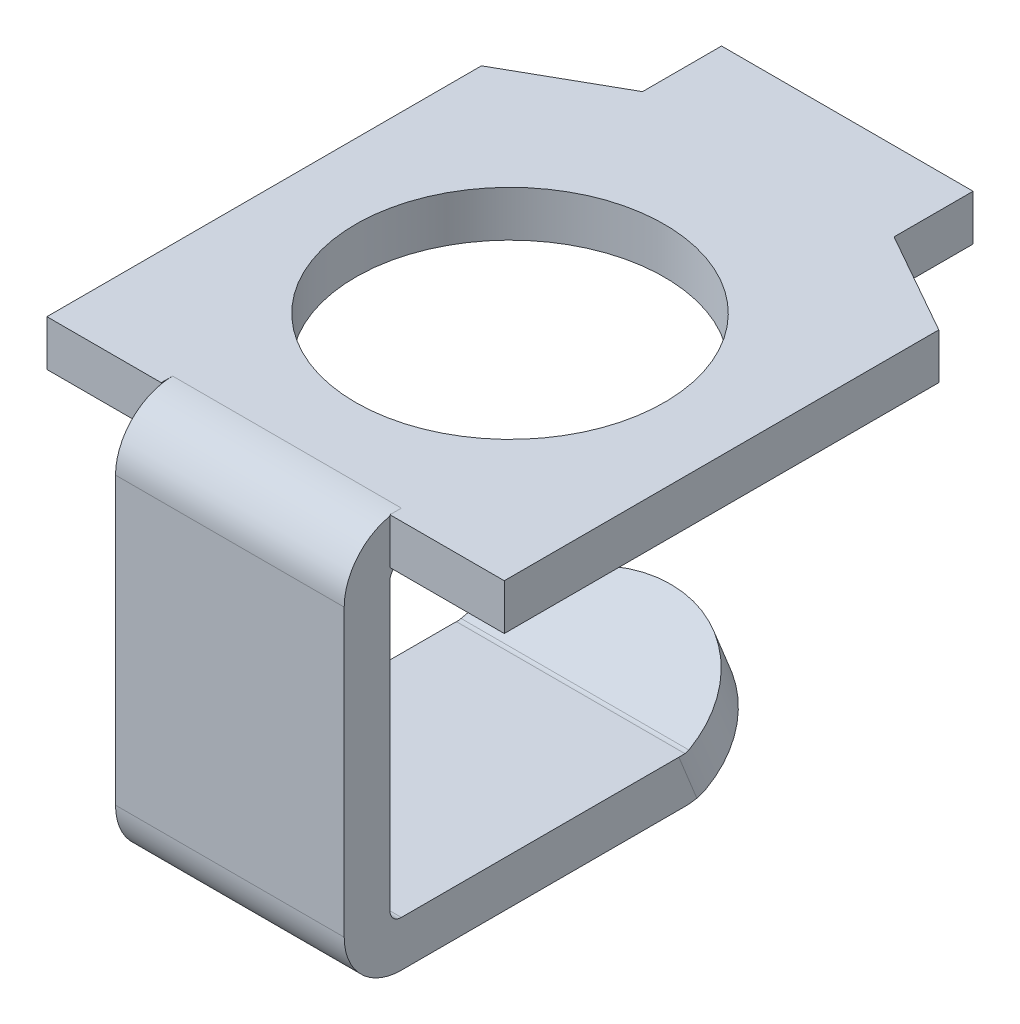
ISO-10303-21;
HEADER;
FILE_DESCRIPTION(('STEP AP214'),'2;1');
FILE_NAME('part.step','',(''),(''),'','','');
FILE_SCHEMA(('AUTOMOTIVE_DESIGN { 1 0 10303 214 1 1 1 1 }'));
ENDSEC;
DATA;
#1=APPLICATION_CONTEXT('core data for automotive mechanical design processes');
#2=APPLICATION_PROTOCOL_DEFINITION('international standard','automotive_design',2000,#1);
#3=PRODUCT_CONTEXT('',#1,'mechanical');
#4=PRODUCT('Part','Part','',(#3));
#5=PRODUCT_RELATED_PRODUCT_CATEGORY('part','',(#4));
#6=PRODUCT_DEFINITION_FORMATION('','',#4);
#7=PRODUCT_DEFINITION_CONTEXT('part definition',#1,'design');
#8=PRODUCT_DEFINITION('design','',#6,#7);
#9=PRODUCT_DEFINITION_SHAPE('','',#8);
#10=(LENGTH_UNIT() NAMED_UNIT(*) SI_UNIT(.MILLI.,.METRE.));
#11=(NAMED_UNIT(*) PLANE_ANGLE_UNIT() SI_UNIT($,.RADIAN.));
#12=(NAMED_UNIT(*) SI_UNIT($,.STERADIAN.) SOLID_ANGLE_UNIT());
#13=UNCERTAINTY_MEASURE_WITH_UNIT(LENGTH_MEASURE(1.E-05),#10,'distance_accuracy_value','');
#14=(GEOMETRIC_REPRESENTATION_CONTEXT(3) GLOBAL_UNCERTAINTY_ASSIGNED_CONTEXT((#13)) GLOBAL_UNIT_ASSIGNED_CONTEXT((#10,
#11,#12)) REPRESENTATION_CONTEXT('',''));
#15=CARTESIAN_POINT('',(0.,0.,0.));
#16=DIRECTION('',(0.,0.,1.));
#17=DIRECTION('',(1.,0.,0.));
#18=AXIS2_PLACEMENT_3D('',#15,#16,#17);
#19=CARTESIAN_POINT('',(-0.0110000000000005,-3.12632059043869,-1.00531058481528));
#20=DIRECTION('',(0.,0.374606593415892,-0.927183854566795));
#21=DIRECTION('',(0.,0.927183854566795,0.374606593415892));
#22=AXIS2_PLACEMENT_3D('',#19,#20,#21);
#23=PLANE('',#22);
#24=DIRECTION('',(1.,0.,0.));
#25=VECTOR('',#24,1.);
#26=CARTESIAN_POINT('',(0.,-3.12539340658412,-1.00493597822187));
#27=LINE('',#26,#25);
#28=CARTESIAN_POINT('',(-0.0100000000000002,-3.12539340658412,-1.00493597822187));
#29=VERTEX_POINT('',#28);
#30=CARTESIAN_POINT('',(0.00999999999999981,-3.12539340658412,-1.00493597822187));
#31=VERTEX_POINT('',#30);
#32=EDGE_CURVE('E298',#29,#31,#27,.T.);
#33=ORIENTED_EDGE('',*,*,#32,.F.);
#34=DIRECTION('',(0.,-0.927183854566789,-0.374606593415907));
#35=VECTOR('',#34,1.);
#36=CARTESIAN_POINT('',(-0.0100000000000002,-2.9272664395512,-0.924887487495394));
#37=LINE('',#36,#35);
#38=CARTESIAN_POINT('',(-0.0100000000000002,-2.75451986475741,-0.855093340855509));
#39=VERTEX_POINT('',#38);
#40=EDGE_CURVE('E196',#39,#29,#37,.T.);
#41=ORIENTED_EDGE('',*,*,#40,.F.);
#42=DIRECTION('',(-1.,0.,0.));
#43=VECTOR('',#42,1.);
#44=CARTESIAN_POINT('',(0.,-2.75451986475741,-0.85509334085551));
#45=LINE('',#44,#43);
#46=CARTESIAN_POINT('',(0.00999999999999981,-2.75451986475741,-0.85509334085551));
#47=VERTEX_POINT('',#46);
#48=EDGE_CURVE('E195',#47,#39,#45,.T.);
#49=ORIENTED_EDGE('',*,*,#48,.F.);
#50=DIRECTION('',(0.,0.92718385456679,0.374606593415905));
#51=VECTOR('',#50,1.);
#52=CARTESIAN_POINT('',(0.00999999999999981,-2.9272664395512,-0.924887487495394));
#53=LINE('',#52,#51);
#54=EDGE_CURVE('E186',#31,#47,#53,.T.);
#55=ORIENTED_EDGE('',*,*,#54,.F.);
#56=EDGE_LOOP('',(#33,#41,#49,#55));
#57=FACE_BOUND('',#56,.T.);
#58=ADVANCED_FACE('F16',(#57),#23,.T.);
#59=CARTESIAN_POINT('',(0.00999999999999981,-3.49625393406586,-0.0870239622007444));
#60=DIRECTION('',(0.,0.927183854566793,0.374606593415898));
#61=DIRECTION('',(0.,-0.374606593415898,0.927183854566793));
#62=AXIS2_PLACEMENT_3D('',#59,#60,#61);
#63=CYLINDRICAL_SURFACE('',#62,0.99);
#64=DIRECTION('',(0.,-0.92718385456679,-0.374606593415904));
#65=VECTOR('',#64,1.);
#66=CARTESIAN_POINT('',(1.,-3.29812696703294,-0.00697547147426942));
#67=LINE('',#66,#65);
#68=CARTESIAN_POINT('',(1.,-3.10000000000002,0.073073019252204));
#69=VERTEX_POINT('',#68);
#70=CARTESIAN_POINT('',(0.999999999999997,-3.48915095371944,-0.0841541718592019));
#71=VERTEX_POINT('',#70);
#72=EDGE_CURVE('E217',#69,#71,#67,.T.);
#73=ORIENTED_EDGE('',*,*,#72,.T.);
#74=CARTESIAN_POINT('',(1.,-3.48915095371944,-0.0841541718592034));
#75=CARTESIAN_POINT('',(1.00000461894513,-3.48610632466005,-0.0985067299631322));
#76=CARTESIAN_POINT('',(0.999686350895516,-3.48245409126056,-0.112658933510028));
#77=CARTESIAN_POINT('',(0.998404040806894,-3.47393441578178,-0.140562631488319));
#78=CARTESIAN_POINT('',(0.997439998767947,-3.46906697370262,-0.154314125919755));
#79=CARTESIAN_POINT('',(0.996153069734331,-3.46359192728349,-0.167865265794199));
#80=B_SPLINE_CURVE_WITH_KNOTS('',3,(#74,#75,#76,#77,#78,#79),.UNSPECIFIED.,.F.,.F.,(4,2,4),(0.,
0.0438580063078256,0.0877160126111364),.UNSPECIFIED.);
#81=CARTESIAN_POINT('',(0.996153069734284,-3.46359192728344,-0.167865265794189));
#82=VERTEX_POINT('',#81);
#83=EDGE_CURVE('E219',#71,#82,#80,.T.);
#84=ORIENTED_EDGE('',*,*,#83,.T.);
#85=CARTESIAN_POINT('',(0.00999999999999981,-3.49625393406586,-0.0870239622007446));
#86=DIRECTION('',(0.,0.927183854566793,0.374606593415898));
#87=DIRECTION('',(0.,-0.374606593415898,0.927183854566793));
#88=AXIS2_PLACEMENT_3D('',#85,#86,#87);
#89=CIRCLE('',#88,0.99);
#90=EDGE_CURVE('E209',#31,#82,#89,.F.);
#91=ORIENTED_EDGE('',*,*,#90,.F.);
#92=ORIENTED_EDGE('',*,*,#54,.T.);
#93=CARTESIAN_POINT('',(0.00999999999999981,-3.12538039223914,0.0628186751656138));
#94=DIRECTION('',(0.,0.927183854566793,0.374606593415898));
#95=DIRECTION('',(0.,-0.374606593415898,0.927183854566793));
#96=AXIS2_PLACEMENT_3D('',#93,#94,#95);
#97=CIRCLE('',#96,0.99);
#98=CARTESIAN_POINT('',(0.996153069734236,-3.0927183854567,-0.0180226284278196));
#99=VERTEX_POINT('',#98);
#100=EDGE_CURVE('E188',#99,#47,#97,.T.);
#101=ORIENTED_EDGE('',*,*,#100,.F.);
#102=CARTESIAN_POINT('',(0.996153069734236,-3.09271838545669,-0.0180226284278271));
#103=CARTESIAN_POINT('',(0.996720451579096,-3.09513259076818,-0.0120218853753864));
#104=CARTESIAN_POINT('',(0.99722057083701,-3.09694649463586,-0.00589979224094122));
#105=CARTESIAN_POINT('',(0.998086284179902,-3.09937369948629,0.00658709420572628));
#106=CARTESIAN_POINT('',(0.998451878264583,-3.09998700046638,0.0129518875184838));
#107=CARTESIAN_POINT('',(0.998750209762022,-3.10000000000002,0.019438030913781));
#108=B_SPLINE_CURVE_WITH_KNOTS('',3,(#102,#103,#104,#105,#106,#107),.UNSPECIFIED.,.F.,.F.,(4,2,
4),(0.,0.019214148894534,0.0384282978314385),.UNSPECIFIED.);
#109=CARTESIAN_POINT('',(0.998750209762022,-3.10000000000002,0.0194380309137797));
#110=VERTEX_POINT('',#109);
#111=EDGE_CURVE('E20',#99,#110,#108,.T.);
#112=ORIENTED_EDGE('',*,*,#111,.T.);
#113=CARTESIAN_POINT('',(0.00999999999999981,-3.10000000000002,0.0730730192522024));
#114=DIRECTION('',(0.,1.,0.));
#115=DIRECTION('',(0.,0.,1.));
#116=AXIS2_PLACEMENT_3D('',#113,#114,#115);
#117=ELLIPSE('',#116,1.0677493952508,0.99);
#118=EDGE_CURVE('E185',#110,#69,#117,.F.);
#119=ORIENTED_EDGE('',*,*,#118,.T.);
#120=EDGE_LOOP('',(#73,#84,#91,#92,#101,#112,#119));
#121=FACE_BOUND('',#120,.T.);
#122=ADVANCED_FACE('F190',(#121),#63,.T.);
#123=CARTESIAN_POINT('',(-0.0100000000000002,-3.10000000000002,0.073073019252206));
#124=DIRECTION('',(0.,-0.927183854566793,-0.3746065934159));
#125=DIRECTION('',(0.,0.3746065934159,-0.927183854566793));
#126=AXIS2_PLACEMENT_3D('',#123,#124,#125);
#127=CYLINDRICAL_SURFACE('',#126,0.99);
#128=ORIENTED_EDGE('',*,*,#40,.T.);
#129=CARTESIAN_POINT('',(-0.0100000000000002,-3.49625393406586,-0.0870239622007415));
#130=DIRECTION('',(0.,-0.927183854566793,-0.3746065934159));
#131=DIRECTION('',(0.,0.3746065934159,-0.927183854566793));
#132=AXIS2_PLACEMENT_3D('',#129,#130,#131);
#133=CIRCLE('',#132,0.99);
#134=CARTESIAN_POINT('',(-0.996153069734236,-3.46359192728341,-0.167865265794178));
#135=VERTEX_POINT('',#134);
#136=EDGE_CURVE('E203',#135,#29,#133,.T.);
#137=ORIENTED_EDGE('',*,*,#136,.F.);
#138=CARTESIAN_POINT('',(-0.996153069734235,-3.46359192728341,-0.167865265794187));
#139=CARTESIAN_POINT('',(-0.997439998767898,-3.46906697370256,-0.154314125919751));
#140=CARTESIAN_POINT('',(-0.998404040806877,-3.47393441578174,-0.140562631488327));
#141=CARTESIAN_POINT('',(-0.999686350895531,-3.48245409126062,-0.112658933510071));
#142=CARTESIAN_POINT('',(-1.00000461894514,-3.4861063246602,-0.0985067299631986));
#143=CARTESIAN_POINT('',(-1.,-3.48915095371968,-0.0841541718592972));
#144=B_SPLINE_CURVE_WITH_KNOTS('',3,(#138,#139,#140,#141,#142,#143),.UNSPECIFIED.,.F.,.F.,(4,2,
4),(0.,0.0438580063033148,0.0877160126111282),.UNSPECIFIED.);
#145=CARTESIAN_POINT('',(-1.,-3.48915095371946,-0.0841541718592085));
#146=VERTEX_POINT('',#145);
#147=EDGE_CURVE('E230',#135,#146,#144,.T.);
#148=ORIENTED_EDGE('',*,*,#147,.T.);
#149=DIRECTION('',(0.,0.92718385456679,0.374606593415905));
#150=VECTOR('',#149,1.);
#151=CARTESIAN_POINT('',(-1.,-3.29812696703294,-0.0069754714742691));
#152=LINE('',#151,#150);
#153=CARTESIAN_POINT('',(-1.,-3.10000000000002,0.0730730192522062));
#154=VERTEX_POINT('',#153);
#155=EDGE_CURVE('E226',#146,#154,#152,.T.);
#156=ORIENTED_EDGE('',*,*,#155,.T.);
#157=CARTESIAN_POINT('',(-0.0100000000000002,-3.10000000000002,0.0730730192522062));
#158=DIRECTION('',(0.,1.,0.));
#159=DIRECTION('',(0.,0.,-1.));
#160=AXIS2_PLACEMENT_3D('',#157,#158,#159);
#161=ELLIPSE('',#160,1.0677493952508,0.99);
#162=CARTESIAN_POINT('',(-0.998750209762021,-3.10000000000002,0.0194380309137796));
#163=VERTEX_POINT('',#162);
#164=EDGE_CURVE('E229',#154,#163,#161,.F.);
#165=ORIENTED_EDGE('',*,*,#164,.T.);
#166=CARTESIAN_POINT('',(-0.998750209762021,-3.10000000000002,0.0194380309137809));
#167=CARTESIAN_POINT('',(-0.998451878264583,-3.09998700046638,0.0129518875184836));
#168=CARTESIAN_POINT('',(-0.998086284179902,-3.09937369948629,0.00658709420572616));
#169=CARTESIAN_POINT('',(-0.99722057083701,-3.09694649463586,-0.00589979224094127));
#170=CARTESIAN_POINT('',(-0.996720451579096,-3.09513259076818,-0.0120218853753865));
#171=CARTESIAN_POINT('',(-0.996153069734235,-3.09271838545669,-0.018022628427827));
#172=B_SPLINE_CURVE_WITH_KNOTS('',3,(#166,#167,#168,#169,#170,#171),.UNSPECIFIED.,.F.,.F.,(4,2,
4),(0.,0.0192141489369044,0.0384282978314383),.UNSPECIFIED.);
#173=CARTESIAN_POINT('',(-0.996153069734236,-3.0927183854567,-0.0180226284278205));
#174=VERTEX_POINT('',#173);
#175=EDGE_CURVE('E216',#163,#174,#172,.T.);
#176=ORIENTED_EDGE('',*,*,#175,.T.);
#177=CARTESIAN_POINT('',(-0.0100000000000002,-3.12538039223915,0.0628186751656151));
#178=DIRECTION('',(0.,-0.927183854566793,-0.3746065934159));
#179=DIRECTION('',(0.,0.3746065934159,-0.927183854566793));
#180=AXIS2_PLACEMENT_3D('',#177,#178,#179);
#181=CIRCLE('',#180,0.99);
#182=EDGE_CURVE('E201',#39,#174,#181,.F.);
#183=ORIENTED_EDGE('',*,*,#182,.F.);
#184=EDGE_LOOP('',(#128,#137,#148,#156,#165,#176,#183));
#185=FACE_BOUND('',#184,.T.);
#186=ADVANCED_FACE('F307',(#185),#127,.T.);
#187=CARTESIAN_POINT('',(-0.997153069734238,-2.75414525816399,-0.856020524710075));
#188=DIRECTION('',(0.,0.927183854566791,0.374606593415902));
#189=DIRECTION('',(0.,-0.374606593415902,0.927183854566792));
#190=AXIS2_PLACEMENT_3D('',#187,#188,#189);
#191=PLANE('',#190);
#192=ORIENTED_EDGE('',*,*,#48,.T.);
#193=ORIENTED_EDGE('',*,*,#182,.T.);
#194=DIRECTION('',(-1.,0.,0.));
#195=VECTOR('',#194,1.);
#196=CARTESIAN_POINT('',(0.,-3.0927183854567,-0.0180226284278122));
#197=LINE('',#196,#195);
#198=EDGE_CURVE('E180',#99,#174,#197,.T.);
#199=ORIENTED_EDGE('',*,*,#198,.F.);
#200=ORIENTED_EDGE('',*,*,#100,.T.);
#201=EDGE_LOOP('',(#192,#193,#199,#200));
#202=FACE_BOUND('',#201,.T.);
#203=ADVANCED_FACE('F199',(#202),#191,.T.);
#204=CARTESIAN_POINT('',(-0.997153069734237,-3.46396653387683,-0.166938081939606));
#205=DIRECTION('',(0.,-0.927183854566792,-0.374606593415902));
#206=DIRECTION('',(0.,0.374606593415902,-0.927183854566792));
#207=AXIS2_PLACEMENT_3D('',#204,#205,#206);
#208=PLANE('',#207);
#209=DIRECTION('',(1.,0.,0.));
#210=VECTOR('',#209,1.);
#211=CARTESIAN_POINT('',(0.,-3.46359192728342,-0.167865265794173));
#212=LINE('',#211,#210);
#213=EDGE_CURVE('E202',#135,#82,#212,.T.);
#214=ORIENTED_EDGE('',*,*,#213,.F.);
#215=ORIENTED_EDGE('',*,*,#136,.T.);
#216=ORIENTED_EDGE('',*,*,#32,.T.);
#217=ORIENTED_EDGE('',*,*,#90,.T.);
#218=EDGE_LOOP('',(#214,#215,#216,#217));
#219=FACE_BOUND('',#218,.T.);
#220=ADVANCED_FACE('F315',(#219),#208,.T.);
#221=CARTESIAN_POINT('',(0.998750209762022,-3.,0.0194380309137824));
#222=DIRECTION('',(-1.,0.,0.));
#223=DIRECTION('',(0.,0.,1.));
#224=AXIS2_PLACEMENT_3D('',#221,#222,#223);
#225=CYLINDRICAL_SURFACE('',#224,0.100000000000023);
#226=ORIENTED_EDGE('',*,*,#198,.T.);
#227=ORIENTED_EDGE('',*,*,#175,.F.);
#228=DIRECTION('',(-1.,0.,0.));
#229=VECTOR('',#228,1.);
#230=CARTESIAN_POINT('',(0.,-3.10000000000002,0.0194380309137784));
#231=LINE('',#230,#229);
#232=EDGE_CURVE('E182',#110,#163,#231,.T.);
#233=ORIENTED_EDGE('',*,*,#232,.F.);
#234=ORIENTED_EDGE('',*,*,#111,.F.);
#235=EDGE_LOOP('',(#226,#227,#233,#234));
#236=FACE_BOUND('',#235,.T.);
#237=ADVANCED_FACE('F178',(#236),#225,.F.);
#238=CARTESIAN_POINT('',(-1.00000000000001,-2.99999999999994,0.0194380309137836));
#239=DIRECTION('',(1.,0.,0.));
#240=DIRECTION('',(0.,1.,0.));
#241=AXIS2_PLACEMENT_3D('',#238,#239,#240);
#242=CYLINDRICAL_SURFACE('',#241,0.500000000000077);
#243=CARTESIAN_POINT('',(-1.00000000000001,-2.99999999999994,0.0194380309137836));
#244=DIRECTION('',(1.,0.,0.));
#245=DIRECTION('',(0.,1.,0.));
#246=AXIS2_PLACEMENT_3D('',#243,#244,#245);
#247=CIRCLE('',#246,0.500000000000077);
#248=CARTESIAN_POINT('',(-1.,-3.50000000000002,0.0194380309137834));
#249=VERTEX_POINT('',#248);
#250=EDGE_CURVE('E292',#249,#146,#247,.T.);
#251=ORIENTED_EDGE('',*,*,#250,.T.);
#252=ORIENTED_EDGE('',*,*,#147,.F.);
#253=ORIENTED_EDGE('',*,*,#213,.T.);
#254=ORIENTED_EDGE('',*,*,#83,.F.);
#255=CARTESIAN_POINT('',(0.999999999999994,-2.99999999999992,0.019438030913788));
#256=DIRECTION('',(1.,0.,0.));
#257=DIRECTION('',(0.,1.,0.));
#258=AXIS2_PLACEMENT_3D('',#255,#256,#257);
#259=CIRCLE('',#258,0.500000000000077);
#260=CARTESIAN_POINT('',(0.999999999999997,-3.50000000000001,0.0194380309137865));
#261=VERTEX_POINT('',#260);
#262=EDGE_CURVE('E206',#71,#261,#259,.F.);
#263=ORIENTED_EDGE('',*,*,#262,.T.);
#264=DIRECTION('',(1.,0.,0.));
#265=VECTOR('',#264,1.);
#266=CARTESIAN_POINT('',(0.,-3.50000000000002,0.019438030913781));
#267=LINE('',#266,#265);
#268=EDGE_CURVE('E481',#249,#261,#267,.T.);
#269=ORIENTED_EDGE('',*,*,#268,.F.);
#270=EDGE_LOOP('',(#251,#252,#253,#254,#263,#269));
#271=FACE_BOUND('',#270,.T.);
#272=ADVANCED_FACE('F314',(#271),#242,.T.);
#273=CARTESIAN_POINT('',(-1.001,-3.10000000000002,0.0184380309137784));
#274=DIRECTION('',(0.,1.,0.));
#275=DIRECTION('',(0.,0.,1.));
#276=AXIS2_PLACEMENT_3D('',#273,#274,#275);
#277=PLANE('',#276);
#278=DIRECTION('',(0.,0.,1.));
#279=VECTOR('',#278,1.);
#280=CARTESIAN_POINT('',(-1.,-3.10000000000001,1.25971901545689));
#281=LINE('',#280,#279);
#282=CARTESIAN_POINT('',(-1.,-3.1,2.50000000000001));
#283=VERTEX_POINT('',#282);
#284=EDGE_CURVE('E224',#154,#283,#281,.T.);
#285=ORIENTED_EDGE('',*,*,#284,.T.);
#286=DIRECTION('',(-1.,0.,0.));
#287=VECTOR('',#286,1.);
#288=CARTESIAN_POINT('',(0.,-3.1,2.50000000000001));
#289=LINE('',#288,#287);
#290=CARTESIAN_POINT('',(1.,-3.1,2.50000000000001));
#291=VERTEX_POINT('',#290);
#292=EDGE_CURVE('E287',#291,#283,#289,.T.);
#293=ORIENTED_EDGE('',*,*,#292,.F.);
#294=DIRECTION('',(0.,0.,-1.));
#295=VECTOR('',#294,1.);
#296=CARTESIAN_POINT('',(1.,-3.10000000000001,1.25971901545689));
#297=LINE('',#296,#295);
#298=EDGE_CURVE('E225',#291,#69,#297,.T.);
#299=ORIENTED_EDGE('',*,*,#298,.T.);
#300=ORIENTED_EDGE('',*,*,#118,.F.);
#301=ORIENTED_EDGE('',*,*,#232,.T.);
#302=ORIENTED_EDGE('',*,*,#164,.F.);
#303=EDGE_LOOP('',(#285,#293,#299,#300,#301,#302));
#304=FACE_BOUND('',#303,.T.);
#305=ADVANCED_FACE('F320',(#304),#277,.T.);
#306=CARTESIAN_POINT('',(-1.001,-3.5,2.50100000000001));
#307=DIRECTION('',(0.,-1.,0.));
#308=DIRECTION('',(0.,0.,-1.));
#309=AXIS2_PLACEMENT_3D('',#306,#307,#308);
#310=PLANE('',#309);
#311=DIRECTION('',(1.,0.,0.));
#312=VECTOR('',#311,1.);
#313=CARTESIAN_POINT('',(0.,-3.5,2.50000000000001));
#314=LINE('',#313,#312);
#315=CARTESIAN_POINT('',(-1.,-3.5,2.50000000000001));
#316=VERTEX_POINT('',#315);
#317=CARTESIAN_POINT('',(1.,-3.5,2.50000000000001));
#318=VERTEX_POINT('',#317);
#319=EDGE_CURVE('E281',#316,#318,#314,.T.);
#320=ORIENTED_EDGE('',*,*,#319,.F.);
#321=DIRECTION('',(0.,0.,-1.));
#322=VECTOR('',#321,1.);
#323=CARTESIAN_POINT('',(-1.,-3.50000000000001,1.2597190154569));
#324=LINE('',#323,#322);
#325=EDGE_CURVE('E291',#316,#249,#324,.T.);
#326=ORIENTED_EDGE('',*,*,#325,.T.);
#327=ORIENTED_EDGE('',*,*,#268,.T.);
#328=DIRECTION('',(0.,0.,1.));
#329=VECTOR('',#328,1.);
#330=CARTESIAN_POINT('',(1.,-3.50000000000001,1.2597190154569));
#331=LINE('',#330,#329);
#332=EDGE_CURVE('E479',#261,#318,#331,.T.);
#333=ORIENTED_EDGE('',*,*,#332,.T.);
#334=EDGE_LOOP('',(#320,#326,#327,#333));
#335=FACE_BOUND('',#334,.T.);
#336=ADVANCED_FACE('F659',(#335),#310,.T.);
#337=CARTESIAN_POINT('',(1.,-3.,2.50000000000001));
#338=DIRECTION('',(-1.,0.,0.));
#339=DIRECTION('',(0.,0.,1.));
#340=AXIS2_PLACEMENT_3D('',#337,#338,#339);
#341=CYLINDRICAL_SURFACE('',#340,0.1);
#342=ORIENTED_EDGE('',*,*,#292,.T.);
#343=CARTESIAN_POINT('',(-1.,-3.,2.50000000000001));
#344=DIRECTION('',(-1.,0.,0.));
#345=DIRECTION('',(0.,0.,1.));
#346=AXIS2_PLACEMENT_3D('',#343,#344,#345);
#347=CIRCLE('',#346,0.1);
#348=CARTESIAN_POINT('',(-1.,-3.,2.60000000000001));
#349=VERTEX_POINT('',#348);
#350=EDGE_CURVE('E285',#283,#349,#347,.T.);
#351=ORIENTED_EDGE('',*,*,#350,.T.);
#352=DIRECTION('',(-1.,0.,0.));
#353=VECTOR('',#352,1.);
#354=CARTESIAN_POINT('',(0.,-3.,2.60000000000001));
#355=LINE('',#354,#353);
#356=CARTESIAN_POINT('',(1.,-3.,2.60000000000001));
#357=VERTEX_POINT('',#356);
#358=EDGE_CURVE('E280',#357,#349,#355,.T.);
#359=ORIENTED_EDGE('',*,*,#358,.F.);
#360=CARTESIAN_POINT('',(1.,-3.,2.50000000000001));
#361=DIRECTION('',(-1.,0.,0.));
#362=DIRECTION('',(0.,0.,1.));
#363=AXIS2_PLACEMENT_3D('',#360,#361,#362);
#364=CIRCLE('',#363,0.1);
#365=EDGE_CURVE('E288',#357,#291,#364,.F.);
#366=ORIENTED_EDGE('',*,*,#365,.T.);
#367=EDGE_LOOP('',(#342,#351,#359,#366));
#368=FACE_BOUND('',#367,.T.);
#369=ADVANCED_FACE('F514',(#368),#341,.F.);
#370=CARTESIAN_POINT('',(-1.,-3.,2.50000000000001));
#371=DIRECTION('',(1.,0.,0.));
#372=DIRECTION('',(0.,0.,-1.));
#373=AXIS2_PLACEMENT_3D('',#370,#371,#372);
#374=CYLINDRICAL_SURFACE('',#373,0.5);
#375=ORIENTED_EDGE('',*,*,#319,.T.);
#376=CARTESIAN_POINT('',(1.,-3.,2.50000000000001));
#377=DIRECTION('',(1.,0.,0.));
#378=DIRECTION('',(0.,0.,-1.));
#379=AXIS2_PLACEMENT_3D('',#376,#377,#378);
#380=CIRCLE('',#379,0.5);
#381=CARTESIAN_POINT('',(1.,-3.,3.00000000000001));
#382=VERTEX_POINT('',#381);
#383=EDGE_CURVE('E278',#318,#382,#380,.F.);
#384=ORIENTED_EDGE('',*,*,#383,.T.);
#385=DIRECTION('',(1.,0.,0.));
#386=VECTOR('',#385,1.);
#387=CARTESIAN_POINT('',(0.,-3.,3.00000000000001));
#388=LINE('',#387,#386);
#389=CARTESIAN_POINT('',(-1.,-3.,3.00000000000001));
#390=VERTEX_POINT('',#389);
#391=EDGE_CURVE('E462',#390,#382,#388,.T.);
#392=ORIENTED_EDGE('',*,*,#391,.F.);
#393=CARTESIAN_POINT('',(-1.,-3.,2.50000000000001));
#394=DIRECTION('',(1.,0.,0.));
#395=DIRECTION('',(0.,0.,-1.));
#396=AXIS2_PLACEMENT_3D('',#393,#394,#395);
#397=CIRCLE('',#396,0.5);
#398=EDGE_CURVE('E282',#390,#316,#397,.T.);
#399=ORIENTED_EDGE('',*,*,#398,.T.);
#400=EDGE_LOOP('',(#375,#384,#392,#399));
#401=FACE_BOUND('',#400,.T.);
#402=ADVANCED_FACE('F654',(#401),#374,.T.);
#403=CARTESIAN_POINT('',(-1.001,-3.001,2.60000000000001));
#404=DIRECTION('',(0.,0.,-1.));
#405=DIRECTION('',(0.,1.,0.));
#406=AXIS2_PLACEMENT_3D('',#403,#404,#405);
#407=PLANE('',#406);
#408=DIRECTION('',(-1.,0.,0.));
#409=VECTOR('',#408,1.);
#410=CARTESIAN_POINT('',(0.,-0.5,2.6));
#411=LINE('',#410,#409);
#412=CARTESIAN_POINT('',(1.,-0.5,2.6));
#413=VERTEX_POINT('',#412);
#414=CARTESIAN_POINT('',(-1.,-0.5,2.6));
#415=VERTEX_POINT('',#414);
#416=EDGE_CURVE('E273',#413,#415,#411,.T.);
#417=ORIENTED_EDGE('',*,*,#416,.F.);
#418=DIRECTION('',(0.,-1.,0.));
#419=VECTOR('',#418,1.);
#420=CARTESIAN_POINT('',(1.,-1.75,2.6));
#421=LINE('',#420,#419);
#422=EDGE_CURVE('E466',#413,#357,#421,.T.);
#423=ORIENTED_EDGE('',*,*,#422,.T.);
#424=ORIENTED_EDGE('',*,*,#358,.T.);
#425=DIRECTION('',(0.,1.,0.));
#426=VECTOR('',#425,1.);
#427=CARTESIAN_POINT('',(-1.,-1.75,2.6));
#428=LINE('',#427,#426);
#429=EDGE_CURVE('E469',#349,#415,#428,.T.);
#430=ORIENTED_EDGE('',*,*,#429,.T.);
#431=EDGE_LOOP('',(#417,#423,#424,#430));
#432=FACE_BOUND('',#431,.T.);
#433=ADVANCED_FACE('F517',(#432),#407,.T.);
#434=CARTESIAN_POINT('',(-1.001,-0.498999999999998,3.));
#435=DIRECTION('',(0.,0.,1.));
#436=DIRECTION('',(0.,-1.,0.));
#437=AXIS2_PLACEMENT_3D('',#434,#435,#436);
#438=PLANE('',#437);
#439=DIRECTION('',(0.,1.,0.));
#440=VECTOR('',#439,1.);
#441=CARTESIAN_POINT('',(1.,-1.75,3.00000000000001));
#442=LINE('',#441,#440);
#443=CARTESIAN_POINT('',(1.,-0.499999999999998,3.));
#444=VERTEX_POINT('',#443);
#445=EDGE_CURVE('E277',#382,#444,#442,.T.);
#446=ORIENTED_EDGE('',*,*,#445,.T.);
#447=DIRECTION('',(1.,0.,0.));
#448=VECTOR('',#447,1.);
#449=CARTESIAN_POINT('',(0.,-0.499999999999998,3.));
#450=LINE('',#449,#448);
#451=CARTESIAN_POINT('',(-1.,-0.499999999999998,3.));
#452=VERTEX_POINT('',#451);
#453=EDGE_CURVE('E261',#452,#444,#450,.T.);
#454=ORIENTED_EDGE('',*,*,#453,.F.);
#455=DIRECTION('',(0.,-1.,0.));
#456=VECTOR('',#455,1.);
#457=CARTESIAN_POINT('',(-1.,-1.75,3.00000000000001));
#458=LINE('',#457,#456);
#459=EDGE_CURVE('E463',#452,#390,#458,.T.);
#460=ORIENTED_EDGE('',*,*,#459,.T.);
#461=ORIENTED_EDGE('',*,*,#391,.T.);
#462=EDGE_LOOP('',(#446,#454,#460,#461));
#463=FACE_BOUND('',#462,.T.);
#464=ADVANCED_FACE('F648',(#463),#438,.T.);
#465=CARTESIAN_POINT('',(-1.,-0.501,2.499));
#466=DIRECTION('',(-1.,0.,0.));
#467=DIRECTION('',(0.,0.,1.));
#468=AXIS2_PLACEMENT_3D('',#465,#466,#467);
#469=PLANE('',#468);
#470=CARTESIAN_POINT('',(-1.,-0.5,2.5));
#471=DIRECTION('',(-1.,0.,0.));
#472=DIRECTION('',(0.,0.,1.));
#473=AXIS2_PLACEMENT_3D('',#470,#471,#472);
#474=CIRCLE('',#473,0.1);
#475=CARTESIAN_POINT('',(-1.,-0.4,2.5));
#476=VERTEX_POINT('',#475);
#477=EDGE_CURVE('E269',#415,#476,#474,.T.);
#478=ORIENTED_EDGE('',*,*,#477,.F.);
#479=ORIENTED_EDGE('',*,*,#429,.F.);
#480=ORIENTED_EDGE('',*,*,#350,.F.);
#481=ORIENTED_EDGE('',*,*,#284,.F.);
#482=ORIENTED_EDGE('',*,*,#155,.F.);
#483=ORIENTED_EDGE('',*,*,#250,.F.);
#484=ORIENTED_EDGE('',*,*,#325,.F.);
#485=ORIENTED_EDGE('',*,*,#398,.F.);
#486=ORIENTED_EDGE('',*,*,#459,.F.);
#487=CARTESIAN_POINT('',(-1.,-0.499999999999998,2.5));
#488=DIRECTION('',(1.,0.,0.));
#489=DIRECTION('',(0.,0.,-1.));
#490=AXIS2_PLACEMENT_3D('',#487,#488,#489);
#491=CIRCLE('',#490,0.499999999999998);
#492=CARTESIAN_POINT('',(-1.,-0.0101020514439536,2.60000000000289));
#493=VERTEX_POINT('',#492);
#494=EDGE_CURVE('E262',#493,#452,#491,.T.);
#495=ORIENTED_EDGE('',*,*,#494,.F.);
#496=DIRECTION('',(0.,1.,0.));
#497=VECTOR('',#496,1.);
#498=CARTESIAN_POINT('',(-1.,-0.2,2.6));
#499=LINE('',#498,#497);
#500=CARTESIAN_POINT('',(-1.,-0.4,2.6));
#501=VERTEX_POINT('',#500);
#502=EDGE_CURVE('E272',#501,#493,#499,.T.);
#503=ORIENTED_EDGE('',*,*,#502,.F.);
#504=DIRECTION('',(0.,0.,1.));
#505=VECTOR('',#504,1.);
#506=CARTESIAN_POINT('',(-1.,-0.4,0.1));
#507=LINE('',#506,#505);
#508=EDGE_CURVE('E432',#476,#501,#507,.T.);
#509=ORIENTED_EDGE('',*,*,#508,.F.);
#510=EDGE_LOOP('',(#478,#479,#480,#481,#482,#483,#484,#485,#486,#495,#503,#509));
#511=FACE_BOUND('',#510,.T.);
#512=ADVANCED_FACE('F509',(#511),#469,.T.);
#513=CARTESIAN_POINT('',(1.,-0.501,3.001));
#514=DIRECTION('',(1.,0.,0.));
#515=DIRECTION('',(0.,0.,-1.));
#516=AXIS2_PLACEMENT_3D('',#513,#514,#515);
#517=PLANE('',#516);
#518=CARTESIAN_POINT('',(1.,-0.499999999999998,2.5));
#519=DIRECTION('',(1.,0.,0.));
#520=DIRECTION('',(0.,0.,-1.));
#521=AXIS2_PLACEMENT_3D('',#518,#519,#520);
#522=CIRCLE('',#521,0.499999999999998);
#523=CARTESIAN_POINT('',(1.,-0.0101020514439536,2.60000000000289));
#524=VERTEX_POINT('',#523);
#525=EDGE_CURVE('E259',#444,#524,#522,.F.);
#526=ORIENTED_EDGE('',*,*,#525,.F.);
#527=ORIENTED_EDGE('',*,*,#445,.F.);
#528=ORIENTED_EDGE('',*,*,#383,.F.);
#529=ORIENTED_EDGE('',*,*,#332,.F.);
#530=ORIENTED_EDGE('',*,*,#262,.F.);
#531=ORIENTED_EDGE('',*,*,#72,.F.);
#532=ORIENTED_EDGE('',*,*,#298,.F.);
#533=ORIENTED_EDGE('',*,*,#365,.F.);
#534=ORIENTED_EDGE('',*,*,#422,.F.);
#535=CARTESIAN_POINT('',(1.,-0.5,2.5));
#536=DIRECTION('',(-1.,0.,0.));
#537=DIRECTION('',(0.,0.,1.));
#538=AXIS2_PLACEMENT_3D('',#535,#536,#537);
#539=CIRCLE('',#538,0.1);
#540=CARTESIAN_POINT('',(1.,-0.4,2.5));
#541=VERTEX_POINT('',#540);
#542=EDGE_CURVE('E274',#541,#413,#539,.F.);
#543=ORIENTED_EDGE('',*,*,#542,.F.);
#544=DIRECTION('',(0.,0.,-1.));
#545=VECTOR('',#544,1.);
#546=CARTESIAN_POINT('',(1.,-0.4,0.1));
#547=LINE('',#546,#545);
#548=CARTESIAN_POINT('',(1.,-0.4,2.6));
#549=VERTEX_POINT('',#548);
#550=EDGE_CURVE('E362',#549,#541,#547,.T.);
#551=ORIENTED_EDGE('',*,*,#550,.F.);
#552=DIRECTION('',(0.,-1.,0.));
#553=VECTOR('',#552,1.);
#554=CARTESIAN_POINT('',(1.,-0.2,2.6));
#555=LINE('',#554,#553);
#556=EDGE_CURVE('E381',#524,#549,#555,.T.);
#557=ORIENTED_EDGE('',*,*,#556,.F.);
#558=EDGE_LOOP('',(#526,#527,#528,#529,#530,#531,#532,#533,#534,#543,#551,#557));
#559=FACE_BOUND('',#558,.T.);
#560=ADVANCED_FACE('F503',(#559),#517,.T.);
#561=CARTESIAN_POINT('',(1.,-0.5,2.5));
#562=DIRECTION('',(-1.,0.,0.));
#563=DIRECTION('',(0.,0.,1.));
#564=AXIS2_PLACEMENT_3D('',#561,#562,#563);
#565=CYLINDRICAL_SURFACE('',#564,0.1);
#566=ORIENTED_EDGE('',*,*,#416,.T.);
#567=ORIENTED_EDGE('',*,*,#477,.T.);
#568=DIRECTION('',(-1.,0.,0.));
#569=VECTOR('',#568,1.);
#570=CARTESIAN_POINT('',(0.,-0.4,2.5));
#571=LINE('',#570,#569);
#572=EDGE_CURVE('E365',#541,#476,#571,.T.);
#573=ORIENTED_EDGE('',*,*,#572,.F.);
#574=ORIENTED_EDGE('',*,*,#542,.T.);
#575=EDGE_LOOP('',(#566,#567,#573,#574));
#576=FACE_BOUND('',#575,.T.);
#577=ADVANCED_FACE('F519',(#576),#565,.F.);
#578=CARTESIAN_POINT('',(-2.001,-0.401,2.6));
#579=DIRECTION('',(0.,0.,1.));
#580=DIRECTION('',(1.,0.,0.));
#581=AXIS2_PLACEMENT_3D('',#578,#579,#580);
#582=PLANE('',#581);
#583=DIRECTION('',(1.,0.,0.));
#584=VECTOR('',#583,1.);
#585=CARTESIAN_POINT('',(0.,0.,2.6));
#586=LINE('',#585,#584);
#587=CARTESIAN_POINT('',(-2.,0.,2.6));
#588=VERTEX_POINT('',#587);
#589=CARTESIAN_POINT('',(-1.,0.,2.6));
#590=VERTEX_POINT('',#589);
#591=EDGE_CURVE('E372',#588,#590,#586,.T.);
#592=ORIENTED_EDGE('',*,*,#591,.F.);
#593=DIRECTION('',(0.,1.,0.));
#594=VECTOR('',#593,1.);
#595=CARTESIAN_POINT('',(-2.,-0.2,2.6));
#596=LINE('',#595,#594);
#597=CARTESIAN_POINT('',(-2.,-0.4,2.6));
#598=VERTEX_POINT('',#597);
#599=EDGE_CURVE('E429',#598,#588,#596,.T.);
#600=ORIENTED_EDGE('',*,*,#599,.F.);
#601=DIRECTION('',(-1.,0.,0.));
#602=VECTOR('',#601,1.);
#603=CARTESIAN_POINT('',(0.,-0.4,2.6));
#604=LINE('',#603,#602);
#605=EDGE_CURVE('E425',#501,#598,#604,.T.);
#606=ORIENTED_EDGE('',*,*,#605,.F.);
#607=ORIENTED_EDGE('',*,*,#502,.T.);
#608=DIRECTION('',(0.,-1.,0.));
#609=VECTOR('',#608,1.);
#610=CARTESIAN_POINT('',(-1.,-0.00505102572168231,2.6));
#611=LINE('',#610,#609);
#612=EDGE_CURVE('E268',#590,#493,#611,.T.);
#613=ORIENTED_EDGE('',*,*,#612,.F.);
#614=EDGE_LOOP('',(#592,#600,#606,#607,#613));
#615=FACE_BOUND('',#614,.T.);
#616=ADVANCED_FACE('F544',(#615),#582,.T.);
#617=CARTESIAN_POINT('',(-1.,-0.0111020514433647,2.601));
#618=DIRECTION('',(1.,0.,0.));
#619=DIRECTION('',(0.,0.,-1.));
#620=AXIS2_PLACEMENT_3D('',#617,#618,#619);
#621=PLANE('',#620);
#622=CARTESIAN_POINT('',(-1.,-0.499999999999998,2.5));
#623=DIRECTION('',(1.,0.,0.));
#624=DIRECTION('',(0.,0.,-1.));
#625=AXIS2_PLACEMENT_3D('',#622,#623,#624);
#626=CIRCLE('',#625,0.499999999999998);
#627=CARTESIAN_POINT('',(-1.,0.,2.5));
#628=VERTEX_POINT('',#627);
#629=EDGE_CURVE('E265',#628,#493,#626,.T.);
#630=ORIENTED_EDGE('',*,*,#629,.F.);
#631=DIRECTION('',(0.,0.,-1.));
#632=VECTOR('',#631,1.);
#633=CARTESIAN_POINT('',(-1.,0.,0.1));
#634=LINE('',#633,#632);
#635=EDGE_CURVE('E551',#590,#628,#634,.T.);
#636=ORIENTED_EDGE('',*,*,#635,.F.);
#637=ORIENTED_EDGE('',*,*,#612,.T.);
#638=EDGE_LOOP('',(#630,#636,#637));
#639=FACE_BOUND('',#638,.T.);
#640=ADVANCED_FACE('F636',(#639),#621,.T.);
#641=CARTESIAN_POINT('',(-1.,-0.499999999999998,2.5));
#642=DIRECTION('',(1.,0.,0.));
#643=DIRECTION('',(0.,0.,-1.));
#644=AXIS2_PLACEMENT_3D('',#641,#642,#643);
#645=CYLINDRICAL_SURFACE('',#644,0.499999999999998);
#646=ORIENTED_EDGE('',*,*,#525,.T.);
#647=CARTESIAN_POINT('',(1.,-0.499999999999998,2.5));
#648=DIRECTION('',(1.,0.,0.));
#649=DIRECTION('',(0.,0.,-1.));
#650=AXIS2_PLACEMENT_3D('',#647,#648,#649);
#651=CIRCLE('',#650,0.499999999999998);
#652=CARTESIAN_POINT('',(1.,0.,2.5));
#653=VERTEX_POINT('',#652);
#654=EDGE_CURVE('E255',#653,#524,#651,.T.);
#655=ORIENTED_EDGE('',*,*,#654,.F.);
#656=DIRECTION('',(1.,0.,0.));
#657=VECTOR('',#656,1.);
#658=CARTESIAN_POINT('',(0.,0.,2.5));
#659=LINE('',#658,#657);
#660=EDGE_CURVE('E568',#628,#653,#659,.T.);
#661=ORIENTED_EDGE('',*,*,#660,.F.);
#662=ORIENTED_EDGE('',*,*,#629,.T.);
#663=ORIENTED_EDGE('',*,*,#494,.T.);
#664=ORIENTED_EDGE('',*,*,#453,.T.);
#665=EDGE_LOOP('',(#646,#655,#661,#662,#663,#664));
#666=FACE_BOUND('',#665,.T.);
#667=ADVANCED_FACE('F586',(#666),#645,.T.);
#668=CARTESIAN_POINT('',(1.,-0.0111020514433646,2.499));
#669=DIRECTION('',(-1.,0.,0.));
#670=DIRECTION('',(0.,0.,1.));
#671=AXIS2_PLACEMENT_3D('',#668,#669,#670);
#672=PLANE('',#671);
#673=ORIENTED_EDGE('',*,*,#654,.T.);
#674=DIRECTION('',(0.,-1.,0.));
#675=VECTOR('',#674,1.);
#676=CARTESIAN_POINT('',(1.,-0.2,2.6));
#677=LINE('',#676,#675);
#678=CARTESIAN_POINT('',(1.,0.,2.6));
#679=VERTEX_POINT('',#678);
#680=EDGE_CURVE('E258',#679,#524,#677,.T.);
#681=ORIENTED_EDGE('',*,*,#680,.F.);
#682=DIRECTION('',(0.,0.,1.));
#683=VECTOR('',#682,1.);
#684=CARTESIAN_POINT('',(1.,0.,0.1));
#685=LINE('',#684,#683);
#686=EDGE_CURVE('E577',#653,#679,#685,.T.);
#687=ORIENTED_EDGE('',*,*,#686,.F.);
#688=EDGE_LOOP('',(#673,#681,#687));
#689=FACE_BOUND('',#688,.T.);
#690=ADVANCED_FACE('F588',(#689),#672,.T.);
#691=CARTESIAN_POINT('',(0.999,-0.401,2.6));
#692=DIRECTION('',(0.,0.,1.));
#693=DIRECTION('',(1.,0.,0.));
#694=AXIS2_PLACEMENT_3D('',#691,#692,#693);
#695=PLANE('',#694);
#696=DIRECTION('',(-1.,0.,0.));
#697=VECTOR('',#696,1.);
#698=CARTESIAN_POINT('',(0.,-0.4,2.6));
#699=LINE('',#698,#697);
#700=CARTESIAN_POINT('',(2.,-0.4,2.6));
#701=VERTEX_POINT('',#700);
#702=EDGE_CURVE('E368',#701,#549,#699,.T.);
#703=ORIENTED_EDGE('',*,*,#702,.F.);
#704=DIRECTION('',(0.,-1.,0.));
#705=VECTOR('',#704,1.);
#706=CARTESIAN_POINT('',(2.,-0.2,2.6));
#707=LINE('',#706,#705);
#708=CARTESIAN_POINT('',(2.,0.,2.6));
#709=VERTEX_POINT('',#708);
#710=EDGE_CURVE('E384',#709,#701,#707,.T.);
#711=ORIENTED_EDGE('',*,*,#710,.F.);
#712=DIRECTION('',(1.,0.,0.));
#713=VECTOR('',#712,1.);
#714=CARTESIAN_POINT('',(0.,0.,2.6));
#715=LINE('',#714,#713);
#716=EDGE_CURVE('E456',#679,#709,#715,.T.);
#717=ORIENTED_EDGE('',*,*,#716,.F.);
#718=ORIENTED_EDGE('',*,*,#680,.T.);
#719=ORIENTED_EDGE('',*,*,#556,.T.);
#720=EDGE_LOOP('',(#703,#711,#717,#718,#719));
#721=FACE_BOUND('',#720,.T.);
#722=ADVANCED_FACE('F591',(#721),#695,.T.);
#723=CARTESIAN_POINT('',(2.,-0.401,2.601));
#724=DIRECTION('',(1.,0.,0.));
#725=DIRECTION('',(0.,0.,-1.));
#726=AXIS2_PLACEMENT_3D('',#723,#724,#725);
#727=PLANE('',#726);
#728=DIRECTION('',(0.,0.,1.));
#729=VECTOR('',#728,1.);
#730=CARTESIAN_POINT('',(2.,-0.4,0.1));
#731=LINE('',#730,#729);
#732=CARTESIAN_POINT('',(2.,-0.4,-1.2));
#733=VERTEX_POINT('',#732);
#734=EDGE_CURVE('E248',#733,#701,#731,.T.);
#735=ORIENTED_EDGE('',*,*,#734,.F.);
#736=DIRECTION('',(0.,-1.,0.));
#737=VECTOR('',#736,1.);
#738=CARTESIAN_POINT('',(2.,-0.2,-1.2));
#739=LINE('',#738,#737);
#740=CARTESIAN_POINT('',(2.,0.,-1.2));
#741=VERTEX_POINT('',#740);
#742=EDGE_CURVE('E392',#741,#733,#739,.T.);
#743=ORIENTED_EDGE('',*,*,#742,.F.);
#744=DIRECTION('',(0.,0.,-1.));
#745=VECTOR('',#744,1.);
#746=CARTESIAN_POINT('',(2.,0.,0.1));
#747=LINE('',#746,#745);
#748=EDGE_CURVE('E244',#709,#741,#747,.T.);
#749=ORIENTED_EDGE('',*,*,#748,.F.);
#750=ORIENTED_EDGE('',*,*,#710,.T.);
#751=EDGE_LOOP('',(#735,#743,#749,#750));
#752=FACE_BOUND('',#751,.T.);
#753=ADVANCED_FACE('F596',(#752),#727,.T.);
#754=CARTESIAN_POINT('',(2.00087045527619,-0.401,-1.19950775248892));
#755=DIRECTION('',(0.492247511076609,0.,-0.870455276185332));
#756=DIRECTION('',(-0.870455276185332,0.,-0.492247511076609));
#757=AXIS2_PLACEMENT_3D('',#754,#755,#756);
#758=PLANE('',#757);
#759=DIRECTION('',(0.870455276185329,0.,0.492247511076616));
#760=VECTOR('',#759,1.);
#761=CARTESIAN_POINT('',(1.1,-0.4,-1.7089552238806));
#762=LINE('',#761,#760);
#763=CARTESIAN_POINT('',(1.1,-0.4,-1.7089552238806));
#764=VERTEX_POINT('',#763);
#765=EDGE_CURVE('E245',#764,#733,#762,.T.);
#766=ORIENTED_EDGE('',*,*,#765,.F.);
#767=DIRECTION('',(0.,-1.,0.));
#768=VECTOR('',#767,1.);
#769=CARTESIAN_POINT('',(1.1,-0.2,-1.7089552238806));
#770=LINE('',#769,#768);
#771=CARTESIAN_POINT('',(1.1,0.,-1.7089552238806));
#772=VERTEX_POINT('',#771);
#773=EDGE_CURVE('E396',#772,#764,#770,.T.);
#774=ORIENTED_EDGE('',*,*,#773,.F.);
#775=DIRECTION('',(-0.870455276185329,0.,-0.492247511076616));
#776=VECTOR('',#775,1.);
#777=CARTESIAN_POINT('',(2.,0.,-1.2));
#778=LINE('',#777,#776);
#779=EDGE_CURVE('E240',#741,#772,#778,.T.);
#780=ORIENTED_EDGE('',*,*,#779,.F.);
#781=ORIENTED_EDGE('',*,*,#742,.T.);
#782=EDGE_LOOP('',(#766,#774,#780,#781));
#783=FACE_BOUND('',#782,.T.);
#784=ADVANCED_FACE('F599',(#783),#758,.T.);
#785=CARTESIAN_POINT('',(1.1,-0.401,-1.7079552238806));
#786=DIRECTION('',(1.,0.,0.));
#787=DIRECTION('',(0.,0.,-1.));
#788=AXIS2_PLACEMENT_3D('',#785,#786,#787);
#789=PLANE('',#788);
#790=DIRECTION('',(0.,0.,1.));
#791=VECTOR('',#790,1.);
#792=CARTESIAN_POINT('',(1.1,-0.4,0.1));
#793=LINE('',#792,#791);
#794=CARTESIAN_POINT('',(1.1,-0.4,-2.4));
#795=VERTEX_POINT('',#794);
#796=EDGE_CURVE('E249',#795,#764,#793,.T.);
#797=ORIENTED_EDGE('',*,*,#796,.F.);
#798=DIRECTION('',(0.,-1.,0.));
#799=VECTOR('',#798,1.);
#800=CARTESIAN_POINT('',(1.1,-0.2,-2.4));
#801=LINE('',#800,#799);
#802=CARTESIAN_POINT('',(1.1,0.,-2.4));
#803=VERTEX_POINT('',#802);
#804=EDGE_CURVE('E403',#803,#795,#801,.T.);
#805=ORIENTED_EDGE('',*,*,#804,.F.);
#806=DIRECTION('',(0.,0.,-1.));
#807=VECTOR('',#806,1.);
#808=CARTESIAN_POINT('',(1.1,0.,0.1));
#809=LINE('',#808,#807);
#810=EDGE_CURVE('E243',#772,#803,#809,.T.);
#811=ORIENTED_EDGE('',*,*,#810,.F.);
#812=ORIENTED_EDGE('',*,*,#773,.T.);
#813=EDGE_LOOP('',(#797,#805,#811,#812));
#814=FACE_BOUND('',#813,.T.);
#815=ADVANCED_FACE('F603',(#814),#789,.T.);
#816=CARTESIAN_POINT('',(1.101,-0.401,-2.4));
#817=DIRECTION('',(0.,0.,-1.));
#818=DIRECTION('',(-1.,0.,0.));
#819=AXIS2_PLACEMENT_3D('',#816,#817,#818);
#820=PLANE('',#819);
#821=DIRECTION('',(1.,0.,0.));
#822=VECTOR('',#821,1.);
#823=CARTESIAN_POINT('',(0.,-0.4,-2.4));
#824=LINE('',#823,#822);
#825=CARTESIAN_POINT('',(-1.1,-0.4,-2.4));
#826=VERTEX_POINT('',#825);
#827=EDGE_CURVE('E399',#826,#795,#824,.T.);
#828=ORIENTED_EDGE('',*,*,#827,.F.);
#829=DIRECTION('',(0.,-1.,0.));
#830=VECTOR('',#829,1.);
#831=CARTESIAN_POINT('',(-1.1,-0.2,-2.4));
#832=LINE('',#831,#830);
#833=CARTESIAN_POINT('',(-1.1,0.,-2.4));
#834=VERTEX_POINT('',#833);
#835=EDGE_CURVE('E410',#834,#826,#832,.T.);
#836=ORIENTED_EDGE('',*,*,#835,.F.);
#837=DIRECTION('',(-1.,0.,0.));
#838=VECTOR('',#837,1.);
#839=CARTESIAN_POINT('',(0.,0.,-2.4));
#840=LINE('',#839,#838);
#841=EDGE_CURVE('E443',#803,#834,#840,.T.);
#842=ORIENTED_EDGE('',*,*,#841,.F.);
#843=ORIENTED_EDGE('',*,*,#804,.T.);
#844=EDGE_LOOP('',(#828,#836,#842,#843));
#845=FACE_BOUND('',#844,.T.);
#846=ADVANCED_FACE('F608',(#845),#820,.T.);
#847=CARTESIAN_POINT('',(-1.1,-0.401,-2.401));
#848=DIRECTION('',(-1.,0.,0.));
#849=DIRECTION('',(0.,0.,1.));
#850=AXIS2_PLACEMENT_3D('',#847,#848,#849);
#851=PLANE('',#850);
#852=DIRECTION('',(0.,0.,-1.));
#853=VECTOR('',#852,1.);
#854=CARTESIAN_POINT('',(-1.1,-0.4,0.1));
#855=LINE('',#854,#853);
#856=CARTESIAN_POINT('',(-1.1,-0.4,-1.7089552238806));
#857=VERTEX_POINT('',#856);
#858=EDGE_CURVE('E253',#857,#826,#855,.T.);
#859=ORIENTED_EDGE('',*,*,#858,.F.);
#860=DIRECTION('',(0.,-1.,0.));
#861=VECTOR('',#860,1.);
#862=CARTESIAN_POINT('',(-1.1,-0.2,-1.70895522388059));
#863=LINE('',#862,#861);
#864=CARTESIAN_POINT('',(-1.1,0.,-1.7089552238806));
#865=VERTEX_POINT('',#864);
#866=EDGE_CURVE('E419',#865,#857,#863,.T.);
#867=ORIENTED_EDGE('',*,*,#866,.F.);
#868=DIRECTION('',(0.,0.,1.));
#869=VECTOR('',#868,1.);
#870=CARTESIAN_POINT('',(-1.1,0.,0.1));
#871=LINE('',#870,#869);
#872=EDGE_CURVE('E239',#834,#865,#871,.T.);
#873=ORIENTED_EDGE('',*,*,#872,.F.);
#874=ORIENTED_EDGE('',*,*,#835,.T.);
#875=EDGE_LOOP('',(#859,#867,#873,#874));
#876=FACE_BOUND('',#875,.T.);
#877=ADVANCED_FACE('F611',(#876),#851,.T.);
#878=CARTESIAN_POINT('',(-1.09912954472381,-0.401,-1.70944747139167));
#879=DIRECTION('',(-0.492247511076609,0.,-0.870455276185332));
#880=DIRECTION('',(-0.870455276185332,0.,0.492247511076609));
#881=AXIS2_PLACEMENT_3D('',#878,#879,#880);
#882=PLANE('',#881);
#883=DIRECTION('',(0.870455276185329,0.,-0.492247511076616));
#884=VECTOR('',#883,1.);
#885=CARTESIAN_POINT('',(-2.,-0.4,-1.2));
#886=LINE('',#885,#884);
#887=CARTESIAN_POINT('',(-2.,-0.4,-1.2));
#888=VERTEX_POINT('',#887);
#889=EDGE_CURVE('E250',#888,#857,#886,.T.);
#890=ORIENTED_EDGE('',*,*,#889,.F.);
#891=DIRECTION('',(0.,-1.,0.));
#892=VECTOR('',#891,1.);
#893=CARTESIAN_POINT('',(-2.,-0.2,-1.2));
#894=LINE('',#893,#892);
#895=CARTESIAN_POINT('',(-2.,0.,-1.2));
#896=VERTEX_POINT('',#895);
#897=EDGE_CURVE('E41',#896,#888,#894,.T.);
#898=ORIENTED_EDGE('',*,*,#897,.F.);
#899=DIRECTION('',(-0.870455276185329,0.,0.492247511076616));
#900=VECTOR('',#899,1.);
#901=CARTESIAN_POINT('',(-1.1,0.,-1.7089552238806));
#902=LINE('',#901,#900);
#903=EDGE_CURVE('E236',#865,#896,#902,.T.);
#904=ORIENTED_EDGE('',*,*,#903,.F.);
#905=ORIENTED_EDGE('',*,*,#866,.T.);
#906=EDGE_LOOP('',(#890,#898,#904,#905));
#907=FACE_BOUND('',#906,.T.);
#908=ADVANCED_FACE('F612',(#907),#882,.T.);
#909=CARTESIAN_POINT('',(-2.,-0.401,-1.201));
#910=DIRECTION('',(-1.,0.,0.));
#911=DIRECTION('',(0.,0.,1.));
#912=AXIS2_PLACEMENT_3D('',#909,#910,#911);
#913=PLANE('',#912);
#914=DIRECTION('',(0.,0.,-1.));
#915=VECTOR('',#914,1.);
#916=CARTESIAN_POINT('',(-2.,-0.4,0.1));
#917=LINE('',#916,#915);
#918=EDGE_CURVE('E254',#598,#888,#917,.T.);
#919=ORIENTED_EDGE('',*,*,#918,.F.);
#920=ORIENTED_EDGE('',*,*,#599,.T.);
#921=DIRECTION('',(0.,0.,1.));
#922=VECTOR('',#921,1.);
#923=CARTESIAN_POINT('',(-2.,0.,0.1));
#924=LINE('',#923,#922);
#925=EDGE_CURVE('E235',#896,#588,#924,.T.);
#926=ORIENTED_EDGE('',*,*,#925,.F.);
#927=ORIENTED_EDGE('',*,*,#897,.T.);
#928=EDGE_LOOP('',(#919,#920,#926,#927));
#929=FACE_BOUND('',#928,.T.);
#930=ADVANCED_FACE('F356',(#929),#913,.T.);
#931=CARTESIAN_POINT('',(-2.001,-0.4,2.601));
#932=DIRECTION('',(0.,-1.,0.));
#933=DIRECTION('',(0.,0.,-1.));
#934=AXIS2_PLACEMENT_3D('',#931,#932,#933);
#935=PLANE('',#934);
#936=CARTESIAN_POINT('',(0.,-0.4,0.549999999999999));
#937=DIRECTION('',(0.,1.,0.));
#938=DIRECTION('',(0.,0.,1.));
#939=AXIS2_PLACEMENT_3D('',#936,#937,#938);
#940=CIRCLE('',#939,1.35);
#941=CARTESIAN_POINT('',(0.,-0.4,1.9));
#942=VERTEX_POINT('',#941);
#943=EDGE_CURVE('E32',#942,#942,#940,.F.);
#944=ORIENTED_EDGE('',*,*,#943,.F.);
#945=EDGE_LOOP('',(#944));
#946=FACE_BOUND('',#945,.T.);
#947=ORIENTED_EDGE('',*,*,#550,.T.);
#948=ORIENTED_EDGE('',*,*,#572,.T.);
#949=ORIENTED_EDGE('',*,*,#508,.T.);
#950=ORIENTED_EDGE('',*,*,#605,.T.);
#951=ORIENTED_EDGE('',*,*,#918,.T.);
#952=ORIENTED_EDGE('',*,*,#889,.T.);
#953=ORIENTED_EDGE('',*,*,#858,.T.);
#954=ORIENTED_EDGE('',*,*,#827,.T.);
#955=ORIENTED_EDGE('',*,*,#796,.T.);
#956=ORIENTED_EDGE('',*,*,#765,.T.);
#957=ORIENTED_EDGE('',*,*,#734,.T.);
#958=ORIENTED_EDGE('',*,*,#702,.T.);
#959=EDGE_LOOP('',(#947,#948,#949,#950,#951,#952,#953,#954,#955,#956,#957,#958));
#960=FACE_BOUND('',#959,.T.);
#961=ADVANCED_FACE('F348',(#946,#960),#935,.T.);
#962=CARTESIAN_POINT('',(-2.001,0.,-2.401));
#963=DIRECTION('',(0.,1.,0.));
#964=DIRECTION('',(0.,0.,1.));
#965=AXIS2_PLACEMENT_3D('',#962,#963,#964);
#966=PLANE('',#965);
#967=CARTESIAN_POINT('',(0.,0.,0.549999999999999));
#968=DIRECTION('',(0.,1.,0.));
#969=DIRECTION('',(0.,0.,1.));
#970=AXIS2_PLACEMENT_3D('',#967,#968,#969);
#971=CIRCLE('',#970,1.35);
#972=CARTESIAN_POINT('',(0.,0.,1.9));
#973=VERTEX_POINT('',#972);
#974=EDGE_CURVE('E11',#973,#973,#971,.T.);
#975=ORIENTED_EDGE('',*,*,#974,.F.);
#976=EDGE_LOOP('',(#975));
#977=FACE_BOUND('',#976,.T.);
#978=ORIENTED_EDGE('',*,*,#903,.T.);
#979=ORIENTED_EDGE('',*,*,#925,.T.);
#980=ORIENTED_EDGE('',*,*,#591,.T.);
#981=ORIENTED_EDGE('',*,*,#635,.T.);
#982=ORIENTED_EDGE('',*,*,#660,.T.);
#983=ORIENTED_EDGE('',*,*,#686,.T.);
#984=ORIENTED_EDGE('',*,*,#716,.T.);
#985=ORIENTED_EDGE('',*,*,#748,.T.);
#986=ORIENTED_EDGE('',*,*,#779,.T.);
#987=ORIENTED_EDGE('',*,*,#810,.T.);
#988=ORIENTED_EDGE('',*,*,#841,.T.);
#989=ORIENTED_EDGE('',*,*,#872,.T.);
#990=EDGE_LOOP('',(#978,#979,#980,#981,#982,#983,#984,#985,#986,#987,#988,#989));
#991=FACE_BOUND('',#990,.T.);
#992=ADVANCED_FACE('F343',(#977,#991),#966,.T.);
#993=CARTESIAN_POINT('',(0.,-0.4,0.549999999999999));
#994=DIRECTION('',(0.,1.,0.));
#995=DIRECTION('',(0.,0.,1.));
#996=AXIS2_PLACEMENT_3D('',#993,#994,#995);
#997=CYLINDRICAL_SURFACE('',#996,1.35);
#998=ORIENTED_EDGE('',*,*,#974,.T.);
#999=EDGE_LOOP('',(#998));
#1000=FACE_BOUND('',#999,.T.);
#1001=ORIENTED_EDGE('',*,*,#943,.T.);
#1002=EDGE_LOOP('',(#1001));
#1003=FACE_BOUND('',#1002,.T.);
#1004=ADVANCED_FACE('F18',(#1000,#1003),#997,.F.);
#1005=CLOSED_SHELL('',(#58,#122,#186,#203,#220,#237,#272,#305,#336,#369,#402,#433,#464,#512,
#560,#577,#616,#640,#667,#690,#722,#753,#784,#815,#846,#877,#908,#930,#961,#992,#1004));
#1006=MANIFOLD_SOLID_BREP('B1',#1005);
#1007=ADVANCED_BREP_SHAPE_REPRESENTATION('',(#18,#1006),#14);
#1008=SHAPE_DEFINITION_REPRESENTATION(#9,#1007);
ENDSEC;
END-ISO-10303-21;
